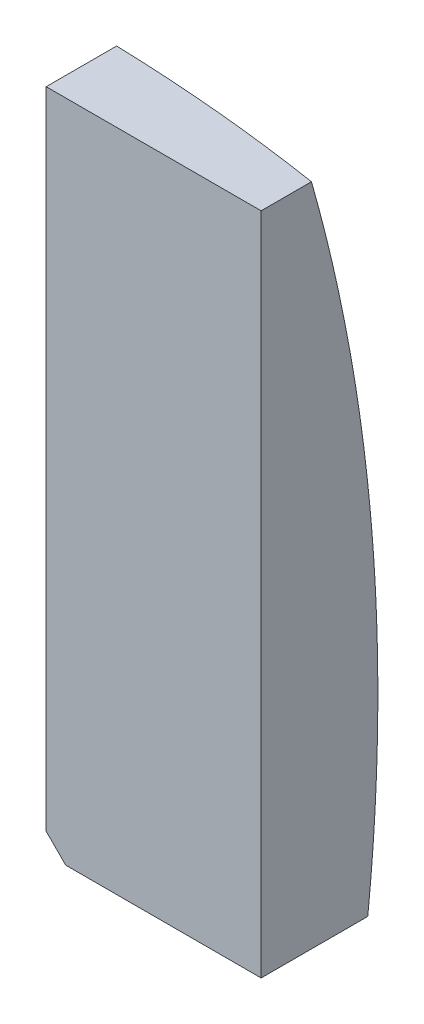
ISO-10303-21;
HEADER;
FILE_DESCRIPTION(('STEP AP214'),'2;1');
FILE_NAME('part.step','',(''),(''),'','','');
FILE_SCHEMA(('AUTOMOTIVE_DESIGN { 1 0 10303 214 1 1 1 1 }'));
ENDSEC;
DATA;
#1=APPLICATION_CONTEXT('core data for automotive mechanical design processes');
#2=APPLICATION_PROTOCOL_DEFINITION('international standard','automotive_design',2000,#1);
#3=PRODUCT_CONTEXT('',#1,'mechanical');
#4=PRODUCT('Part','Part','',(#3));
#5=PRODUCT_RELATED_PRODUCT_CATEGORY('part','',(#4));
#6=PRODUCT_DEFINITION_FORMATION('','',#4);
#7=PRODUCT_DEFINITION_CONTEXT('part definition',#1,'design');
#8=PRODUCT_DEFINITION('design','',#6,#7);
#9=PRODUCT_DEFINITION_SHAPE('','',#8);
#10=(LENGTH_UNIT() NAMED_UNIT(*) SI_UNIT(.MILLI.,.METRE.));
#11=(NAMED_UNIT(*) PLANE_ANGLE_UNIT() SI_UNIT($,.RADIAN.));
#12=(NAMED_UNIT(*) SI_UNIT($,.STERADIAN.) SOLID_ANGLE_UNIT());
#13=UNCERTAINTY_MEASURE_WITH_UNIT(LENGTH_MEASURE(1.E-05),#10,'distance_accuracy_value','');
#14=(GEOMETRIC_REPRESENTATION_CONTEXT(3) GLOBAL_UNCERTAINTY_ASSIGNED_CONTEXT((#13)) GLOBAL_UNIT_ASSIGNED_CONTEXT((#10,
#11,#12)) REPRESENTATION_CONTEXT('',''));
#15=CARTESIAN_POINT('',(0.,0.,0.));
#16=DIRECTION('',(0.,0.,1.));
#17=DIRECTION('',(1.,0.,0.));
#18=AXIS2_PLACEMENT_3D('',#15,#16,#17);
#19=CARTESIAN_POINT('',(0.,0.,0.));
#20=DIRECTION('',(0.,0.,-1.));
#21=DIRECTION('',(-1.,0.,0.));
#22=AXIS2_PLACEMENT_3D('',#19,#20,#21);
#23=PLANE('',#22);
#24=DIRECTION('',(0.,-1.,0.));
#25=VECTOR('',#24,1.);
#26=CARTESIAN_POINT('',(1.3,-30.9414213562373,0.));
#27=LINE('',#26,#25);
#28=CARTESIAN_POINT('',(1.3,12.2,0.));
#29=VERTEX_POINT('',#28);
#30=CARTESIAN_POINT('',(1.3,-4.3,0.));
#31=VERTEX_POINT('',#30);
#32=EDGE_CURVE('E107',#29,#31,#27,.T.);
#33=ORIENTED_EDGE('',*,*,#32,.T.);
#34=DIRECTION('',(-0.70710678118655,0.707106781186545,0.));
#35=VECTOR('',#34,1.);
#36=CARTESIAN_POINT('',(1.3,-4.3,0.));
#37=LINE('',#36,#35);
#38=CARTESIAN_POINT('',(1.8,-4.8,0.));
#39=VERTEX_POINT('',#38);
#40=EDGE_CURVE('E80',#31,#39,#37,.F.);
#41=ORIENTED_EDGE('',*,*,#40,.T.);
#42=DIRECTION('',(1.,0.,0.));
#43=VECTOR('',#42,1.);
#44=CARTESIAN_POINT('',(0.,-4.8,0.));
#45=LINE('',#44,#43);
#46=CARTESIAN_POINT('',(6.8,-4.8,0.));
#47=VERTEX_POINT('',#46);
#48=EDGE_CURVE('E101',#39,#47,#45,.T.);
#49=ORIENTED_EDGE('',*,*,#48,.T.);
#50=DIRECTION('',(0.,-1.,0.));
#51=VECTOR('',#50,1.);
#52=CARTESIAN_POINT('',(6.8,-30.9414213562373,0.));
#53=LINE('',#52,#51);
#54=CARTESIAN_POINT('',(6.8,12.2,0.));
#55=VERTEX_POINT('',#54);
#56=EDGE_CURVE('E105',#55,#47,#53,.T.);
#57=ORIENTED_EDGE('',*,*,#56,.F.);
#58=DIRECTION('',(1.,0.,0.));
#59=VECTOR('',#58,1.);
#60=CARTESIAN_POINT('',(0.,12.2,0.));
#61=LINE('',#60,#59);
#62=EDGE_CURVE('E121',#29,#55,#61,.T.);
#63=ORIENTED_EDGE('',*,*,#62,.F.);
#64=EDGE_LOOP('',(#33,#41,#49,#57,#63));
#65=FACE_BOUND('',#64,.T.);
#66=ADVANCED_FACE('F58',(#65),#23,.F.);
#67=CARTESIAN_POINT('',(6.8,-30.9414213562373,-3.5));
#68=DIRECTION('',(-1.,0.,0.));
#69=DIRECTION('',(0.,-1.,0.));
#70=AXIS2_PLACEMENT_3D('',#67,#68,#69);
#71=PLANE('',#70);
#72=DIRECTION('',(0.,0.,1.));
#73=VECTOR('',#72,1.);
#74=CARTESIAN_POINT('',(6.8,12.2,-3.5));
#75=LINE('',#74,#73);
#76=CARTESIAN_POINT('',(6.79999999999999,12.2,-1.28739056759961));
#77=VERTEX_POINT('',#76);
#78=EDGE_CURVE('E106',#77,#55,#75,.T.);
#79=ORIENTED_EDGE('',*,*,#78,.T.);
#80=ORIENTED_EDGE('',*,*,#56,.T.);
#81=DIRECTION('',(0.,0.,1.));
#82=VECTOR('',#81,1.);
#83=CARTESIAN_POINT('',(6.8,-4.8,-3.5));
#84=LINE('',#83,#82);
#85=CARTESIAN_POINT('',(6.79999999999999,-4.8,-2.72684477762913));
#86=VERTEX_POINT('',#85);
#87=EDGE_CURVE('E110',#86,#47,#84,.T.);
#88=ORIENTED_EDGE('',*,*,#87,.F.);
#89=CARTESIAN_POINT('',(6.8,0.,41.69));
#90=DIRECTION('',(-1.,0.,0.));
#91=DIRECTION('',(0.,-1.,0.));
#92=AXIS2_PLACEMENT_3D('',#89,#90,#91);
#93=CIRCLE('',#92,44.6754529915478);
#94=EDGE_CURVE('E135',#77,#86,#93,.T.);
#95=ORIENTED_EDGE('',*,*,#94,.F.);
#96=EDGE_LOOP('',(#79,#80,#88,#95));
#97=FACE_BOUND('',#96,.T.);
#98=ADVANCED_FACE('F119',(#97),#71,.F.);
#99=CARTESIAN_POINT('',(0.,-4.8,-3.5));
#100=DIRECTION('',(0.,-1.,0.));
#101=DIRECTION('',(1.,0.,0.));
#102=AXIS2_PLACEMENT_3D('',#99,#100,#101);
#103=PLANE('',#102);
#104=ORIENTED_EDGE('',*,*,#48,.F.);
#105=DIRECTION('',(0.,0.,-1.));
#106=VECTOR('',#105,1.);
#107=CARTESIAN_POINT('',(1.8,-4.8,-3.5));
#108=LINE('',#107,#106);
#109=CARTESIAN_POINT('',(1.8,-4.8,-3.20828615882794));
#110=VERTEX_POINT('',#109);
#111=EDGE_CURVE('E66',#39,#110,#108,.T.);
#112=ORIENTED_EDGE('',*,*,#111,.T.);
#113=CARTESIAN_POINT('',(0.,-4.8,41.69));
#114=DIRECTION('',(0.,-1.,0.));
#115=DIRECTION('',(1.,0.,0.));
#116=AXIS2_PLACEMENT_3D('',#113,#114,#115);
#117=CIRCLE('',#116,44.9343532277922);
#118=EDGE_CURVE('E112',#110,#86,#117,.T.);
#119=ORIENTED_EDGE('',*,*,#118,.T.);
#120=ORIENTED_EDGE('',*,*,#87,.T.);
#121=EDGE_LOOP('',(#104,#112,#119,#120));
#122=FACE_BOUND('',#121,.T.);
#123=ADVANCED_FACE('F111',(#122),#103,.T.);
#124=CARTESIAN_POINT('',(1.3,-30.9414213562373,-3.5));
#125=DIRECTION('',(-1.,0.,0.));
#126=DIRECTION('',(0.,-1.,0.));
#127=AXIS2_PLACEMENT_3D('',#124,#125,#126);
#128=PLANE('',#127);
#129=CARTESIAN_POINT('',(1.3,0.,41.69));
#130=DIRECTION('',(-1.,0.,0.));
#131=DIRECTION('',(0.,-1.,0.));
#132=AXIS2_PLACEMENT_3D('',#129,#130,#131);
#133=CIRCLE('',#132,45.1712973026014);
#134=CARTESIAN_POINT('',(1.3,12.2,-1.80259822084673));
#135=VERTEX_POINT('',#134);
#136=CARTESIAN_POINT('',(1.3,-4.3,-3.27616616968808));
#137=VERTEX_POINT('',#136);
#138=EDGE_CURVE('E131',#135,#137,#133,.T.);
#139=ORIENTED_EDGE('',*,*,#138,.T.);
#140=DIRECTION('',(0.,0.,1.));
#141=VECTOR('',#140,1.);
#142=CARTESIAN_POINT('',(1.3,-4.3,-3.5));
#143=LINE('',#142,#141);
#144=EDGE_CURVE('E137',#137,#31,#143,.T.);
#145=ORIENTED_EDGE('',*,*,#144,.T.);
#146=ORIENTED_EDGE('',*,*,#32,.F.);
#147=DIRECTION('',(0.,0.,1.));
#148=VECTOR('',#147,1.);
#149=CARTESIAN_POINT('',(1.3,12.2,-3.5));
#150=LINE('',#149,#148);
#151=EDGE_CURVE('E117',#135,#29,#150,.T.);
#152=ORIENTED_EDGE('',*,*,#151,.F.);
#153=EDGE_LOOP('',(#139,#145,#146,#152));
#154=FACE_BOUND('',#153,.T.);
#155=ADVANCED_FACE('F142',(#154),#128,.T.);
#156=CARTESIAN_POINT('',(0.,12.2,-3.5));
#157=DIRECTION('',(0.,-1.,0.));
#158=DIRECTION('',(0.,0.,-1.));
#159=AXIS2_PLACEMENT_3D('',#156,#157,#158);
#160=PLANE('',#159);
#161=ORIENTED_EDGE('',*,*,#151,.T.);
#162=ORIENTED_EDGE('',*,*,#62,.T.);
#163=ORIENTED_EDGE('',*,*,#78,.F.);
#164=CARTESIAN_POINT('',(0.,12.2,41.69));
#165=DIRECTION('',(0.,-1.,0.));
#166=DIRECTION('',(0.,0.,-1.));
#167=AXIS2_PLACEMENT_3D('',#164,#165,#166);
#168=CIRCLE('',#167,43.5120224765524);
#169=EDGE_CURVE('E116',#135,#77,#168,.T.);
#170=ORIENTED_EDGE('',*,*,#169,.F.);
#171=EDGE_LOOP('',(#161,#162,#163,#170));
#172=FACE_BOUND('',#171,.T.);
#173=ADVANCED_FACE('F148',(#172),#160,.F.);
#174=CARTESIAN_POINT('',(0.,0.,41.69));
#175=DIRECTION('',(0.,0.,-1.));
#176=DIRECTION('',(1.,0.,0.));
#177=AXIS2_PLACEMENT_3D('',#174,#175,#176);
#178=SPHERICAL_SURFACE('',#177,45.19);
#179=ORIENTED_EDGE('',*,*,#118,.F.);
#180=CARTESIAN_POINT('',(-1.5,-1.50000000000002,41.69));
#181=DIRECTION('',(0.707106781186545,0.70710678118655,0.));
#182=DIRECTION('',(-0.70710678118655,0.707106781186545,0.));
#183=AXIS2_PLACEMENT_3D('',#180,#181,#182);
#184=CIRCLE('',#183,45.140182764362);
#185=EDGE_CURVE('E13',#110,#137,#184,.T.);
#186=ORIENTED_EDGE('',*,*,#185,.T.);
#187=ORIENTED_EDGE('',*,*,#138,.F.);
#188=ORIENTED_EDGE('',*,*,#169,.T.);
#189=ORIENTED_EDGE('',*,*,#94,.T.);
#190=EDGE_LOOP('',(#179,#186,#187,#188,#189));
#191=FACE_BOUND('',#190,.T.);
#192=ADVANCED_FACE('F150',(#191),#178,.T.);
#193=CARTESIAN_POINT('',(1.3,-4.3,-3.5));
#194=DIRECTION('',(0.707106781186545,0.70710678118655,0.));
#195=DIRECTION('',(-0.70710678118655,0.707106781186545,0.));
#196=AXIS2_PLACEMENT_3D('',#193,#194,#195);
#197=PLANE('',#196);
#198=ORIENTED_EDGE('',*,*,#185,.F.);
#199=ORIENTED_EDGE('',*,*,#111,.F.);
#200=ORIENTED_EDGE('',*,*,#40,.F.);
#201=ORIENTED_EDGE('',*,*,#144,.F.);
#202=EDGE_LOOP('',(#198,#199,#200,#201));
#203=FACE_BOUND('',#202,.T.);
#204=ADVANCED_FACE('F60',(#203),#197,.F.);
#205=CLOSED_SHELL('',(#66,#98,#123,#155,#173,#192,#204));
#206=MANIFOLD_SOLID_BREP('B2',#205);
#207=ADVANCED_BREP_SHAPE_REPRESENTATION('',(#18,#206),#14);
#208=SHAPE_DEFINITION_REPRESENTATION(#9,#207);
ENDSEC;
END-ISO-10303-21;
